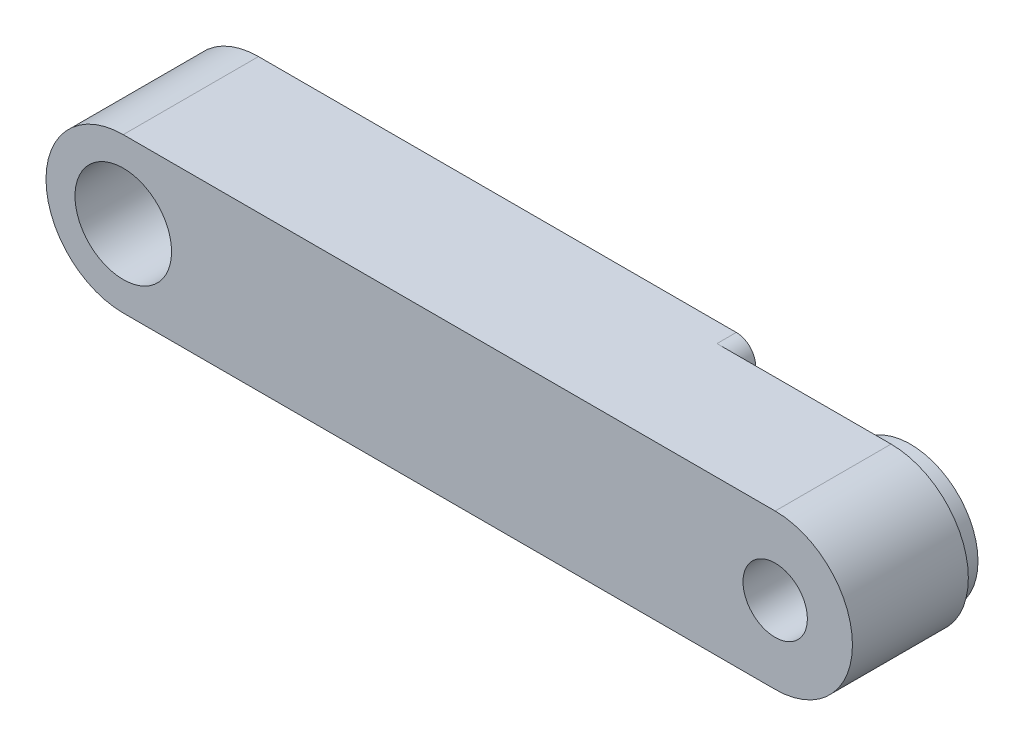
ISO-10303-21;
HEADER;
FILE_DESCRIPTION(('STEP AP214'),'2;1');
FILE_NAME('part.step','',(''),(''),'','','');
FILE_SCHEMA(('AUTOMOTIVE_DESIGN { 1 0 10303 214 1 1 1 1 }'));
ENDSEC;
DATA;
#1=APPLICATION_CONTEXT('core data for automotive mechanical design processes');
#2=APPLICATION_PROTOCOL_DEFINITION('international standard','automotive_design',2000,#1);
#3=PRODUCT_CONTEXT('',#1,'mechanical');
#4=PRODUCT('Part','Part','',(#3));
#5=PRODUCT_RELATED_PRODUCT_CATEGORY('part','',(#4));
#6=PRODUCT_DEFINITION_FORMATION('','',#4);
#7=PRODUCT_DEFINITION_CONTEXT('part definition',#1,'design');
#8=PRODUCT_DEFINITION('design','',#6,#7);
#9=PRODUCT_DEFINITION_SHAPE('','',#8);
#10=(LENGTH_UNIT() NAMED_UNIT(*) SI_UNIT(.MILLI.,.METRE.));
#11=(NAMED_UNIT(*) PLANE_ANGLE_UNIT() SI_UNIT($,.RADIAN.));
#12=(NAMED_UNIT(*) SI_UNIT($,.STERADIAN.) SOLID_ANGLE_UNIT());
#13=UNCERTAINTY_MEASURE_WITH_UNIT(LENGTH_MEASURE(1.E-05),#10,'distance_accuracy_value','');
#14=(GEOMETRIC_REPRESENTATION_CONTEXT(3) GLOBAL_UNCERTAINTY_ASSIGNED_CONTEXT((#13)) GLOBAL_UNIT_ASSIGNED_CONTEXT((#10,
#11,#12)) REPRESENTATION_CONTEXT('',''));
#15=CARTESIAN_POINT('',(0.,0.,0.));
#16=DIRECTION('',(0.,0.,1.));
#17=DIRECTION('',(1.,0.,0.));
#18=AXIS2_PLACEMENT_3D('',#15,#16,#17);
#19=CARTESIAN_POINT('',(33.75,0.,0.));
#20=DIRECTION('',(0.,0.,1.));
#21=DIRECTION('',(1.,0.,0.));
#22=AXIS2_PLACEMENT_3D('',#19,#20,#21);
#23=CYLINDRICAL_SURFACE('',#22,3.5);
#24=CARTESIAN_POINT('',(33.75,0.,1.));
#25=DIRECTION('',(0.,0.,1.));
#26=DIRECTION('',(1.,0.,0.));
#27=AXIS2_PLACEMENT_3D('',#24,#25,#26);
#28=CIRCLE('',#27,3.5);
#29=CARTESIAN_POINT('',(37.25,0.,1.));
#30=VERTEX_POINT('',#29);
#31=EDGE_CURVE('E148',#30,#30,#28,.F.);
#32=ORIENTED_EDGE('',*,*,#31,.T.);
#33=EDGE_LOOP('',(#32));
#34=FACE_BOUND('',#33,.T.);
#35=CARTESIAN_POINT('',(33.75,0.,0.));
#36=DIRECTION('',(0.,0.,1.));
#37=DIRECTION('',(1.,0.,0.));
#38=AXIS2_PLACEMENT_3D('',#35,#36,#37);
#39=CIRCLE('',#38,3.5);
#40=CARTESIAN_POINT('',(37.25,0.,0.));
#41=VERTEX_POINT('',#40);
#42=EDGE_CURVE('E145',#41,#41,#39,.T.);
#43=ORIENTED_EDGE('',*,*,#42,.T.);
#44=EDGE_LOOP('',(#43));
#45=FACE_BOUND('',#44,.T.);
#46=ADVANCED_FACE('F16',(#34,#45),#23,.T.);
#47=CARTESIAN_POINT('',(24.73612181134,-3.,0.));
#48=DIRECTION('',(0.,0.,1.));
#49=DIRECTION('',(1.,0.,0.));
#50=AXIS2_PLACEMENT_3D('',#47,#48,#49);
#51=CYLINDRICAL_SURFACE('',#50,1.);
#52=CARTESIAN_POINT('',(24.73612181134,-3.,1.));
#53=DIRECTION('',(0.,0.,1.));
#54=DIRECTION('',(1.,0.,0.));
#55=AXIS2_PLACEMENT_3D('',#52,#53,#54);
#56=CIRCLE('',#55,1.);
#57=CARTESIAN_POINT('',(25.6849510943569,-2.6842105263158,1.));
#58=VERTEX_POINT('',#57);
#59=CARTESIAN_POINT('',(24.73612181134,-4.,1.));
#60=VERTEX_POINT('',#59);
#61=EDGE_CURVE('E151',#58,#60,#56,.F.);
#62=ORIENTED_EDGE('',*,*,#61,.T.);
#63=DIRECTION('',(0.,0.,1.));
#64=VECTOR('',#63,1.);
#65=CARTESIAN_POINT('',(24.73612181134,-4.,0.));
#66=LINE('',#65,#64);
#67=CARTESIAN_POINT('',(24.73612181134,-4.,0.));
#68=VERTEX_POINT('',#67);
#69=EDGE_CURVE('E119',#60,#68,#66,.F.);
#70=ORIENTED_EDGE('',*,*,#69,.T.);
#71=CARTESIAN_POINT('',(24.73612181134,-3.,0.));
#72=DIRECTION('',(0.,0.,1.));
#73=DIRECTION('',(1.,0.,0.));
#74=AXIS2_PLACEMENT_3D('',#71,#72,#73);
#75=CIRCLE('',#74,1.);
#76=CARTESIAN_POINT('',(25.6849510943569,-2.6842105263158,0.));
#77=VERTEX_POINT('',#76);
#78=EDGE_CURVE('E143',#68,#77,#75,.T.);
#79=ORIENTED_EDGE('',*,*,#78,.T.);
#80=DIRECTION('',(0.,0.,-1.));
#81=VECTOR('',#80,1.);
#82=CARTESIAN_POINT('',(25.6849510943569,-2.68421052631581,0.));
#83=LINE('',#82,#81);
#84=EDGE_CURVE('E116',#77,#58,#83,.F.);
#85=ORIENTED_EDGE('',*,*,#84,.T.);
#86=EDGE_LOOP('',(#62,#70,#79,#85));
#87=FACE_BOUND('',#86,.T.);
#88=ADVANCED_FACE('F159',(#87),#51,.T.);
#89=CARTESIAN_POINT('',(33.75,0.,0.));
#90=DIRECTION('',(0.,0.,-1.));
#91=DIRECTION('',(-1.,0.,0.));
#92=AXIS2_PLACEMENT_3D('',#89,#90,#91);
#93=CYLINDRICAL_SURFACE('',#92,8.50000000000001);
#94=CARTESIAN_POINT('',(33.75,0.,0.));
#95=DIRECTION('',(0.,0.,-1.));
#96=DIRECTION('',(-1.,0.,0.));
#97=AXIS2_PLACEMENT_3D('',#94,#95,#96);
#98=CIRCLE('',#97,8.50000000000001);
#99=CARTESIAN_POINT('',(25.6849510943568,2.6842105263158,0.));
#100=VERTEX_POINT('',#99);
#101=EDGE_CURVE('E141',#77,#100,#98,.T.);
#102=ORIENTED_EDGE('',*,*,#101,.T.);
#103=DIRECTION('',(0.,0.,-1.));
#104=VECTOR('',#103,1.);
#105=CARTESIAN_POINT('',(25.6849510943568,2.68421052631581,0.));
#106=LINE('',#105,#104);
#107=CARTESIAN_POINT('',(25.6849510943568,2.6842105263158,1.));
#108=VERTEX_POINT('',#107);
#109=EDGE_CURVE('E89',#108,#100,#106,.T.);
#110=ORIENTED_EDGE('',*,*,#109,.F.);
#111=CARTESIAN_POINT('',(33.75,0.,1.));
#112=DIRECTION('',(0.,0.,-1.));
#113=DIRECTION('',(-1.,0.,0.));
#114=AXIS2_PLACEMENT_3D('',#111,#112,#113);
#115=CIRCLE('',#114,8.50000000000001);
#116=EDGE_CURVE('E99',#108,#58,#115,.F.);
#117=ORIENTED_EDGE('',*,*,#116,.T.);
#118=ORIENTED_EDGE('',*,*,#84,.F.);
#119=EDGE_LOOP('',(#102,#110,#117,#118));
#120=FACE_BOUND('',#119,.T.);
#121=ADVANCED_FACE('F156',(#120),#93,.F.);
#122=CARTESIAN_POINT('',(24.73612181134,3.,0.));
#123=DIRECTION('',(0.,0.,-1.));
#124=DIRECTION('',(-1.,0.,0.));
#125=AXIS2_PLACEMENT_3D('',#122,#123,#124);
#126=CYLINDRICAL_SURFACE('',#125,1.);
#127=CARTESIAN_POINT('',(24.73612181134,3.,0.));
#128=DIRECTION('',(0.,0.,-1.));
#129=DIRECTION('',(-1.,0.,0.));
#130=AXIS2_PLACEMENT_3D('',#127,#128,#129);
#131=CIRCLE('',#130,1.);
#132=CARTESIAN_POINT('',(24.73612181134,4.,0.));
#133=VERTEX_POINT('',#132);
#134=EDGE_CURVE('E84',#100,#133,#131,.F.);
#135=ORIENTED_EDGE('',*,*,#134,.T.);
#136=DIRECTION('',(0.,0.,-1.));
#137=VECTOR('',#136,1.);
#138=CARTESIAN_POINT('',(24.73612181134,4.,0.));
#139=LINE('',#138,#137);
#140=CARTESIAN_POINT('',(24.73612181134,4.,1.));
#141=VERTEX_POINT('',#140);
#142=EDGE_CURVE('E78',#133,#141,#139,.F.);
#143=ORIENTED_EDGE('',*,*,#142,.T.);
#144=CARTESIAN_POINT('',(24.73612181134,3.,1.));
#145=DIRECTION('',(0.,0.,-1.));
#146=DIRECTION('',(-1.,0.,0.));
#147=AXIS2_PLACEMENT_3D('',#144,#145,#146);
#148=CIRCLE('',#147,1.);
#149=EDGE_CURVE('E19',#141,#108,#148,.T.);
#150=ORIENTED_EDGE('',*,*,#149,.T.);
#151=ORIENTED_EDGE('',*,*,#109,.T.);
#152=EDGE_LOOP('',(#135,#143,#150,#151));
#153=FACE_BOUND('',#152,.T.);
#154=ADVANCED_FACE('F80',(#153),#126,.T.);
#155=CARTESIAN_POINT('',(31.875,0.,1.));
#156=DIRECTION('',(0.,0.,1.));
#157=DIRECTION('',(1.,0.,0.));
#158=AXIS2_PLACEMENT_3D('',#155,#156,#157);
#159=PLANE('',#158);
#160=ORIENTED_EDGE('',*,*,#31,.F.);
#161=EDGE_LOOP('',(#160));
#162=FACE_BOUND('',#161,.T.);
#163=DIRECTION('',(1.,0.,0.));
#164=VECTOR('',#163,1.);
#165=CARTESIAN_POINT('',(-4.,-4.,1.));
#166=LINE('',#165,#164);
#167=CARTESIAN_POINT('',(33.75,-4.,1.));
#168=VERTEX_POINT('',#167);
#169=EDGE_CURVE('E109',#60,#168,#166,.T.);
#170=ORIENTED_EDGE('',*,*,#169,.F.);
#171=ORIENTED_EDGE('',*,*,#61,.F.);
#172=ORIENTED_EDGE('',*,*,#116,.F.);
#173=ORIENTED_EDGE('',*,*,#149,.F.);
#174=DIRECTION('',(1.,0.,0.));
#175=VECTOR('',#174,1.);
#176=CARTESIAN_POINT('',(37.75,4.,1.));
#177=LINE('',#176,#175);
#178=CARTESIAN_POINT('',(33.75,4.,1.));
#179=VERTEX_POINT('',#178);
#180=EDGE_CURVE('E96',#179,#141,#177,.F.);
#181=ORIENTED_EDGE('',*,*,#180,.F.);
#182=CARTESIAN_POINT('',(33.75,0.,1.));
#183=DIRECTION('',(0.,0.,1.));
#184=DIRECTION('',(1.,0.,0.));
#185=AXIS2_PLACEMENT_3D('',#182,#183,#184);
#186=CIRCLE('',#185,4.);
#187=EDGE_CURVE('E136',#168,#179,#186,.T.);
#188=ORIENTED_EDGE('',*,*,#187,.F.);
#189=EDGE_LOOP('',(#170,#171,#172,#173,#181,#188));
#190=FACE_BOUND('',#189,.T.);
#191=ADVANCED_FACE('F94',(#162,#190),#159,.F.);
#192=CARTESIAN_POINT('',(16.875,0.,0.));
#193=DIRECTION('',(0.,0.,1.));
#194=DIRECTION('',(1.,0.,0.));
#195=AXIS2_PLACEMENT_3D('',#192,#193,#194);
#196=PLANE('',#195);
#197=CARTESIAN_POINT('',(33.75,0.,0.));
#198=DIRECTION('',(0.,0.,1.));
#199=DIRECTION('',(1.,0.,0.));
#200=AXIS2_PLACEMENT_3D('',#197,#198,#199);
#201=CIRCLE('',#200,1.666);
#202=CARTESIAN_POINT('',(35.416,0.,0.));
#203=VERTEX_POINT('',#202);
#204=EDGE_CURVE('E103',#203,#203,#201,.T.);
#205=ORIENTED_EDGE('',*,*,#204,.T.);
#206=EDGE_LOOP('',(#205));
#207=FACE_BOUND('',#206,.T.);
#208=ORIENTED_EDGE('',*,*,#42,.F.);
#209=EDGE_LOOP('',(#208));
#210=FACE_BOUND('',#209,.T.);
#211=ADVANCED_FACE('F190',(#207,#210),#196,.F.);
#212=CARTESIAN_POINT('',(16.875,0.,0.));
#213=DIRECTION('',(0.,0.,1.));
#214=DIRECTION('',(1.,0.,0.));
#215=AXIS2_PLACEMENT_3D('',#212,#213,#214);
#216=PLANE('',#215);
#217=CARTESIAN_POINT('',(0.,0.,0.));
#218=DIRECTION('',(0.,0.,1.));
#219=DIRECTION('',(1.,0.,0.));
#220=AXIS2_PLACEMENT_3D('',#217,#218,#219);
#221=CIRCLE('',#220,2.5);
#222=CARTESIAN_POINT('',(2.5,0.,0.));
#223=VERTEX_POINT('',#222);
#224=EDGE_CURVE('E131',#223,#223,#221,.T.);
#225=ORIENTED_EDGE('',*,*,#224,.T.);
#226=EDGE_LOOP('',(#225));
#227=FACE_BOUND('',#226,.T.);
#228=DIRECTION('',(1.,0.,0.));
#229=VECTOR('',#228,1.);
#230=CARTESIAN_POINT('',(37.75,4.,0.));
#231=LINE('',#230,#229);
#232=CARTESIAN_POINT('',(0.,4.,0.));
#233=VERTEX_POINT('',#232);
#234=EDGE_CURVE('E101',#133,#233,#231,.F.);
#235=ORIENTED_EDGE('',*,*,#234,.F.);
#236=ORIENTED_EDGE('',*,*,#134,.F.);
#237=ORIENTED_EDGE('',*,*,#101,.F.);
#238=ORIENTED_EDGE('',*,*,#78,.F.);
#239=DIRECTION('',(1.,0.,0.));
#240=VECTOR('',#239,1.);
#241=CARTESIAN_POINT('',(-4.,-4.,0.));
#242=LINE('',#241,#240);
#243=CARTESIAN_POINT('',(0.,-4.,0.));
#244=VERTEX_POINT('',#243);
#245=EDGE_CURVE('E112',#244,#68,#242,.T.);
#246=ORIENTED_EDGE('',*,*,#245,.F.);
#247=CARTESIAN_POINT('',(0.,0.,0.));
#248=DIRECTION('',(0.,0.,1.));
#249=DIRECTION('',(1.,0.,0.));
#250=AXIS2_PLACEMENT_3D('',#247,#248,#249);
#251=CIRCLE('',#250,4.);
#252=EDGE_CURVE('E138',#233,#244,#251,.T.);
#253=ORIENTED_EDGE('',*,*,#252,.F.);
#254=EDGE_LOOP('',(#235,#236,#237,#238,#246,#253));
#255=FACE_BOUND('',#254,.T.);
#256=ADVANCED_FACE('F163',(#227,#255),#216,.F.);
#257=CARTESIAN_POINT('',(0.,0.,0.));
#258=DIRECTION('',(0.,0.,1.));
#259=DIRECTION('',(1.,0.,0.));
#260=AXIS2_PLACEMENT_3D('',#257,#258,#259);
#261=CYLINDRICAL_SURFACE('',#260,4.);
#262=ORIENTED_EDGE('',*,*,#252,.T.);
#263=DIRECTION('',(0.,0.,-1.));
#264=VECTOR('',#263,1.);
#265=CARTESIAN_POINT('',(0.,-4.,0.));
#266=LINE('',#265,#264);
#267=CARTESIAN_POINT('',(0.,-4.,7.));
#268=VERTEX_POINT('',#267);
#269=EDGE_CURVE('E115',#268,#244,#266,.T.);
#270=ORIENTED_EDGE('',*,*,#269,.F.);
#271=CARTESIAN_POINT('',(0.,0.,7.));
#272=DIRECTION('',(0.,0.,1.));
#273=DIRECTION('',(1.,0.,0.));
#274=AXIS2_PLACEMENT_3D('',#271,#272,#273);
#275=CIRCLE('',#274,4.);
#276=CARTESIAN_POINT('',(0.,4.,7.));
#277=VERTEX_POINT('',#276);
#278=EDGE_CURVE('E128',#277,#268,#275,.T.);
#279=ORIENTED_EDGE('',*,*,#278,.F.);
#280=DIRECTION('',(0.,0.,1.));
#281=VECTOR('',#280,1.);
#282=CARTESIAN_POINT('',(0.,4.,0.));
#283=LINE('',#282,#281);
#284=EDGE_CURVE('E105',#233,#277,#283,.T.);
#285=ORIENTED_EDGE('',*,*,#284,.F.);
#286=EDGE_LOOP('',(#262,#270,#279,#285));
#287=FACE_BOUND('',#286,.T.);
#288=ADVANCED_FACE('F180',(#287),#261,.T.);
#289=CARTESIAN_POINT('',(-4.,-4.,0.));
#290=DIRECTION('',(0.,-1.,0.));
#291=DIRECTION('',(0.,0.,-1.));
#292=AXIS2_PLACEMENT_3D('',#289,#290,#291);
#293=PLANE('',#292);
#294=DIRECTION('',(0.,0.,1.));
#295=VECTOR('',#294,1.);
#296=CARTESIAN_POINT('',(33.75,-4.,0.));
#297=LINE('',#296,#295);
#298=CARTESIAN_POINT('',(33.75,-4.,7.));
#299=VERTEX_POINT('',#298);
#300=EDGE_CURVE('E111',#299,#168,#297,.F.);
#301=ORIENTED_EDGE('',*,*,#300,.F.);
#302=DIRECTION('',(1.,0.,0.));
#303=VECTOR('',#302,1.);
#304=CARTESIAN_POINT('',(16.875,-4.,7.));
#305=LINE('',#304,#303);
#306=EDGE_CURVE('E127',#268,#299,#305,.T.);
#307=ORIENTED_EDGE('',*,*,#306,.F.);
#308=ORIENTED_EDGE('',*,*,#269,.T.);
#309=ORIENTED_EDGE('',*,*,#245,.T.);
#310=ORIENTED_EDGE('',*,*,#69,.F.);
#311=ORIENTED_EDGE('',*,*,#169,.T.);
#312=EDGE_LOOP('',(#301,#307,#308,#309,#310,#311));
#313=FACE_BOUND('',#312,.T.);
#314=ADVANCED_FACE('F166',(#313),#293,.T.);
#315=CARTESIAN_POINT('',(33.75,0.,0.));
#316=DIRECTION('',(0.,0.,1.));
#317=DIRECTION('',(1.,0.,0.));
#318=AXIS2_PLACEMENT_3D('',#315,#316,#317);
#319=CYLINDRICAL_SURFACE('',#318,4.);
#320=ORIENTED_EDGE('',*,*,#187,.T.);
#321=DIRECTION('',(0.,0.,1.));
#322=VECTOR('',#321,1.);
#323=CARTESIAN_POINT('',(33.75,4.,0.));
#324=LINE('',#323,#322);
#325=CARTESIAN_POINT('',(33.75,4.,7.));
#326=VERTEX_POINT('',#325);
#327=EDGE_CURVE('E34',#326,#179,#324,.F.);
#328=ORIENTED_EDGE('',*,*,#327,.F.);
#329=CARTESIAN_POINT('',(33.75,0.,7.));
#330=DIRECTION('',(0.,0.,1.));
#331=DIRECTION('',(1.,0.,0.));
#332=AXIS2_PLACEMENT_3D('',#329,#330,#331);
#333=CIRCLE('',#332,4.);
#334=EDGE_CURVE('E124',#299,#326,#333,.T.);
#335=ORIENTED_EDGE('',*,*,#334,.F.);
#336=ORIENTED_EDGE('',*,*,#300,.T.);
#337=EDGE_LOOP('',(#320,#328,#335,#336));
#338=FACE_BOUND('',#337,.T.);
#339=ADVANCED_FACE('F188',(#338),#319,.T.);
#340=CARTESIAN_POINT('',(37.75,4.,0.));
#341=DIRECTION('',(0.,1.,0.));
#342=DIRECTION('',(0.,0.,1.));
#343=AXIS2_PLACEMENT_3D('',#340,#341,#342);
#344=PLANE('',#343);
#345=ORIENTED_EDGE('',*,*,#142,.F.);
#346=ORIENTED_EDGE('',*,*,#234,.T.);
#347=ORIENTED_EDGE('',*,*,#284,.T.);
#348=DIRECTION('',(1.,0.,0.));
#349=VECTOR('',#348,1.);
#350=CARTESIAN_POINT('',(16.875,4.,7.));
#351=LINE('',#350,#349);
#352=EDGE_CURVE('E123',#326,#277,#351,.F.);
#353=ORIENTED_EDGE('',*,*,#352,.F.);
#354=ORIENTED_EDGE('',*,*,#327,.T.);
#355=ORIENTED_EDGE('',*,*,#180,.T.);
#356=EDGE_LOOP('',(#345,#346,#347,#353,#354,#355));
#357=FACE_BOUND('',#356,.T.);
#358=ADVANCED_FACE('F100',(#357),#344,.T.);
#359=CARTESIAN_POINT('',(33.75,0.,0.));
#360=DIRECTION('',(0.,0.,1.));
#361=DIRECTION('',(1.,0.,0.));
#362=AXIS2_PLACEMENT_3D('',#359,#360,#361);
#363=CYLINDRICAL_SURFACE('',#362,1.666);
#364=ORIENTED_EDGE('',*,*,#204,.F.);
#365=EDGE_LOOP('',(#364));
#366=FACE_BOUND('',#365,.T.);
#367=CARTESIAN_POINT('',(33.75,0.,7.));
#368=DIRECTION('',(0.,0.,1.));
#369=DIRECTION('',(1.,0.,0.));
#370=AXIS2_PLACEMENT_3D('',#367,#368,#369);
#371=CIRCLE('',#370,1.666);
#372=CARTESIAN_POINT('',(35.416,0.,7.));
#373=VERTEX_POINT('',#372);
#374=EDGE_CURVE('E25',#373,#373,#371,.F.);
#375=ORIENTED_EDGE('',*,*,#374,.F.);
#376=EDGE_LOOP('',(#375));
#377=FACE_BOUND('',#376,.T.);
#378=ADVANCED_FACE('F200',(#366,#377),#363,.F.);
#379=CARTESIAN_POINT('',(0.,0.,0.));
#380=DIRECTION('',(0.,0.,1.));
#381=DIRECTION('',(1.,0.,0.));
#382=AXIS2_PLACEMENT_3D('',#379,#380,#381);
#383=CYLINDRICAL_SURFACE('',#382,2.5);
#384=ORIENTED_EDGE('',*,*,#224,.F.);
#385=EDGE_LOOP('',(#384));
#386=FACE_BOUND('',#385,.T.);
#387=CARTESIAN_POINT('',(0.,0.,7.));
#388=DIRECTION('',(0.,0.,1.));
#389=DIRECTION('',(1.,0.,0.));
#390=AXIS2_PLACEMENT_3D('',#387,#388,#389);
#391=CIRCLE('',#390,2.5);
#392=CARTESIAN_POINT('',(2.5,0.,7.));
#393=VERTEX_POINT('',#392);
#394=EDGE_CURVE('E11',#393,#393,#391,.F.);
#395=ORIENTED_EDGE('',*,*,#394,.F.);
#396=EDGE_LOOP('',(#395));
#397=FACE_BOUND('',#396,.T.);
#398=ADVANCED_FACE('F194',(#386,#397),#383,.F.);
#399=CARTESIAN_POINT('',(16.875,0.,7.));
#400=DIRECTION('',(0.,0.,1.));
#401=DIRECTION('',(1.,0.,0.));
#402=AXIS2_PLACEMENT_3D('',#399,#400,#401);
#403=PLANE('',#402);
#404=ORIENTED_EDGE('',*,*,#394,.T.);
#405=EDGE_LOOP('',(#404));
#406=FACE_BOUND('',#405,.T.);
#407=ORIENTED_EDGE('',*,*,#374,.T.);
#408=EDGE_LOOP('',(#407));
#409=FACE_BOUND('',#408,.T.);
#410=ORIENTED_EDGE('',*,*,#334,.T.);
#411=ORIENTED_EDGE('',*,*,#352,.T.);
#412=ORIENTED_EDGE('',*,*,#278,.T.);
#413=ORIENTED_EDGE('',*,*,#306,.T.);
#414=EDGE_LOOP('',(#410,#411,#412,#413));
#415=FACE_BOUND('',#414,.T.);
#416=ADVANCED_FACE('F178',(#406,#409,#415),#403,.T.);
#417=CLOSED_SHELL('',(#46,#88,#121,#154,#191,#211,#256,#288,#314,#339,#358,#378,#398,#416));
#418=MANIFOLD_SOLID_BREP('B1',#417);
#419=ADVANCED_BREP_SHAPE_REPRESENTATION('',(#18,#418),#14);
#420=SHAPE_DEFINITION_REPRESENTATION(#9,#419);
ENDSEC;
END-ISO-10303-21;
